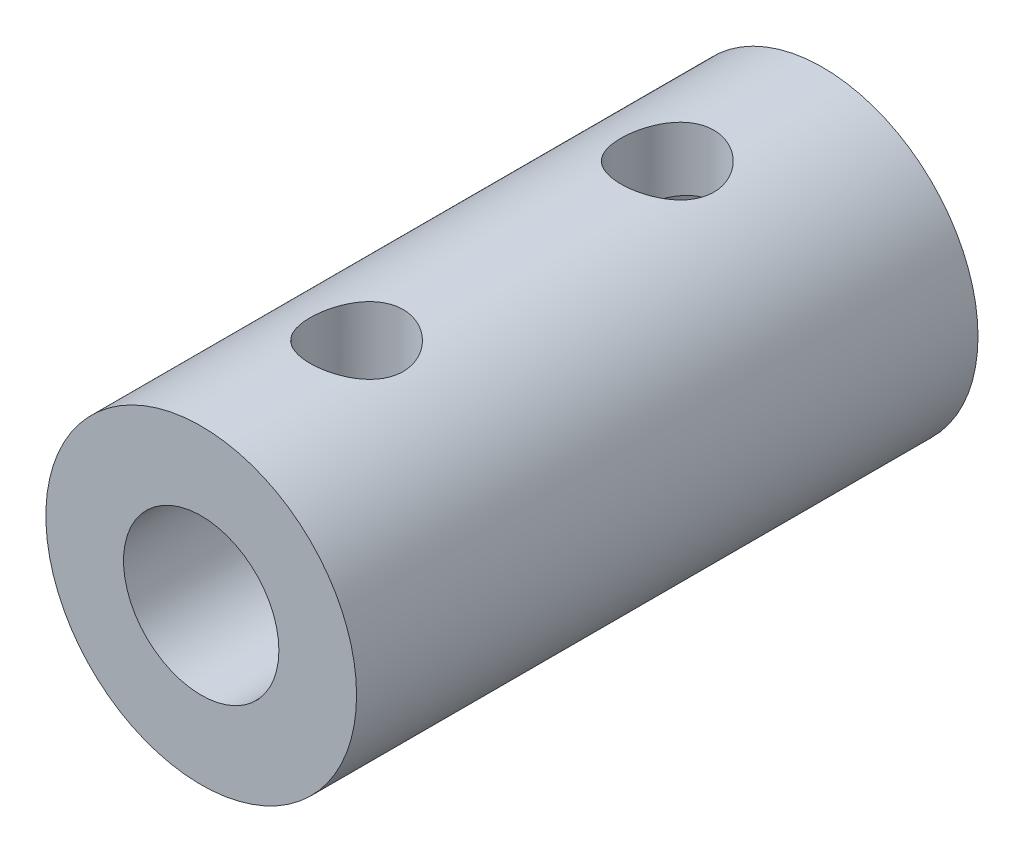
ISO-10303-21;
HEADER;
FILE_DESCRIPTION(('STEP AP214'),'2;1');
FILE_NAME('part.step','',(''),(''),'','','');
FILE_SCHEMA(('AUTOMOTIVE_DESIGN { 1 0 10303 214 1 1 1 1 }'));
ENDSEC;
DATA;
#1=APPLICATION_CONTEXT('core data for automotive mechanical design processes');
#2=APPLICATION_PROTOCOL_DEFINITION('international standard','automotive_design',2000,#1);
#3=PRODUCT_CONTEXT('',#1,'mechanical');
#4=PRODUCT('Part','Part','',(#3));
#5=PRODUCT_RELATED_PRODUCT_CATEGORY('part','',(#4));
#6=PRODUCT_DEFINITION_FORMATION('','',#4);
#7=PRODUCT_DEFINITION_CONTEXT('part definition',#1,'design');
#8=PRODUCT_DEFINITION('design','',#6,#7);
#9=PRODUCT_DEFINITION_SHAPE('','',#8);
#10=(LENGTH_UNIT() NAMED_UNIT(*) SI_UNIT(.MILLI.,.METRE.));
#11=(NAMED_UNIT(*) PLANE_ANGLE_UNIT() SI_UNIT($,.RADIAN.));
#12=(NAMED_UNIT(*) SI_UNIT($,.STERADIAN.) SOLID_ANGLE_UNIT());
#13=UNCERTAINTY_MEASURE_WITH_UNIT(LENGTH_MEASURE(1.E-05),#10,'distance_accuracy_value','');
#14=(GEOMETRIC_REPRESENTATION_CONTEXT(3) GLOBAL_UNCERTAINTY_ASSIGNED_CONTEXT((#13)) GLOBAL_UNIT_ASSIGNED_CONTEXT((#10,
#11,#12)) REPRESENTATION_CONTEXT('',''));
#15=CARTESIAN_POINT('',(0.,0.,0.));
#16=DIRECTION('',(0.,0.,1.));
#17=DIRECTION('',(1.,0.,0.));
#18=AXIS2_PLACEMENT_3D('',#15,#16,#17);
#19=CARTESIAN_POINT('',(0.,0.,10.));
#20=DIRECTION('',(0.,0.,-1.));
#21=DIRECTION('',(-1.,0.,0.));
#22=AXIS2_PLACEMENT_3D('',#19,#20,#21);
#23=CYLINDRICAL_SURFACE('',#22,5.);
#24=CARTESIAN_POINT('',(0.,0.,0.));
#25=DIRECTION('',(0.,0.,1.));
#26=DIRECTION('',(1.,0.,0.));
#27=AXIS2_PLACEMENT_3D('',#24,#25,#26);
#28=CIRCLE('',#27,5.);
#29=CARTESIAN_POINT('',(5.,0.,0.));
#30=VERTEX_POINT('',#29);
#31=EDGE_CURVE('E10',#30,#30,#28,.T.);
#32=ORIENTED_EDGE('',*,*,#31,.T.);
#33=EDGE_LOOP('',(#32));
#34=FACE_BOUND('',#33,.T.);
#35=CARTESIAN_POINT('',(0.,0.,20.));
#36=DIRECTION('',(0.,0.,1.));
#37=DIRECTION('',(1.,0.,0.));
#38=AXIS2_PLACEMENT_3D('',#35,#36,#37);
#39=CIRCLE('',#38,5.);
#40=CARTESIAN_POINT('',(5.,0.,20.));
#41=VERTEX_POINT('',#40);
#42=EDGE_CURVE('E93',#41,#41,#39,.T.);
#43=ORIENTED_EDGE('',*,*,#42,.F.);
#44=EDGE_LOOP('',(#43));
#45=FACE_BOUND('',#44,.T.);
#46=CARTESIAN_POINT('',(0.,5.,13.5));
#47=CARTESIAN_POINT('',(-0.0822886127532981,4.9999992925055,13.5000009974849));
#48=CARTESIAN_POINT('',(-0.164587318351528,4.99794915693954,13.506793863624));
#49=CARTESIAN_POINT('',(-0.326788125304879,4.98997105593691,13.5337213542221));
#50=CARTESIAN_POINT('',(-0.406689504411418,4.98404193389692,13.5538599580233));
#51=CARTESIAN_POINT('',(-0.561732707754525,4.96895552501836,13.6067460169103));
#52=CARTESIAN_POINT('',(-0.636881364395371,4.95980300250425,13.6394748696189));
#53=CARTESIAN_POINT('',(-0.780624181053129,4.93922109237645,13.7165360930558));
#54=CARTESIAN_POINT('',(-0.849217467469668,4.92779140192067,13.7608700073954));
#55=CARTESIAN_POINT('',(-0.979871797183744,4.90350737192774,13.8612240074727));
#56=CARTESIAN_POINT('',(-1.04171807124434,4.89062383657036,13.9175166258859));
#57=CARTESIAN_POINT('',(-1.15524920923324,4.86505834210442,14.0396092299102));
#58=CARTESIAN_POINT('',(-1.20693236327441,4.85237641724501,14.105410812125));
#59=CARTESIAN_POINT('',(-1.29980037723707,4.82834113993772,14.2464707530376));
#60=CARTESIAN_POINT('',(-1.34072309022213,4.81702406663875,14.3219084609907));
#61=CARTESIAN_POINT('',(-1.4092139477476,4.79743620394031,14.4789892542303));
#62=CARTESIAN_POINT('',(-1.43678529919973,4.78916468313311,14.560630843928));
#63=CARTESIAN_POINT('',(-1.47701633682652,4.77690870838434,14.7253902661305));
#64=CARTESIAN_POINT('',(-1.49007196234677,4.77281069324533,14.8084027438639));
#65=CARTESIAN_POINT('',(-1.50213730614672,4.76902789749767,14.9755331562168));
#66=CARTESIAN_POINT('',(-1.50115042761078,4.76934204760571,15.0596508180591));
#67=CARTESIAN_POINT('',(-1.48546977199812,4.77424744067778,15.2233839086085));
#68=CARTESIAN_POINT('',(-1.47127205262685,4.77868388599141,15.3030522503622));
#69=CARTESIAN_POINT('',(-1.43037420427056,4.79108356228624,15.4588197862735));
#70=CARTESIAN_POINT('',(-1.40367284141641,4.79904714132351,15.5349186273743));
#71=CARTESIAN_POINT('',(-1.33816026653681,4.81772733074973,15.6826003496607));
#72=CARTESIAN_POINT('',(-1.29918816934642,4.82848016115952,15.7541070839553));
#73=CARTESIAN_POINT('',(-1.21035222588683,4.85150987000065,15.8897320220102));
#74=CARTESIAN_POINT('',(-1.16048574002588,4.86378711746991,15.9538484294138));
#75=CARTESIAN_POINT('',(-1.04881290765546,4.88911011297937,16.075686190762));
#76=CARTESIAN_POINT('',(-0.986594907466971,4.90216654310498,16.1330286640297));
#77=CARTESIAN_POINT('',(-0.853263259313966,4.92712244063259,16.2365539840643));
#78=CARTESIAN_POINT('',(-0.782149051860887,4.9390218351841,16.2827361284144));
#79=CARTESIAN_POINT('',(-0.632355038342802,4.9604316006947,16.3628599224647));
#80=CARTESIAN_POINT('',(-0.553627749747949,4.96992543668314,16.3967175162499));
#81=CARTESIAN_POINT('',(-0.391245415603517,4.98533521832222,16.4505995900996));
#82=CARTESIAN_POINT('',(-0.307591751589579,4.99125216186999,16.4706279285325));
#83=CARTESIAN_POINT('',(-0.140952242668329,4.99868364643538,16.4956521778994));
#84=CARTESIAN_POINT('',(-0.0580500976011841,5.0003485041779,16.5011615858016));
#85=CARTESIAN_POINT('',(0.107499605823386,4.9995292324176,16.4984308442879));
#86=CARTESIAN_POINT('',(0.190147196690783,4.99704565677756,16.4901925303486));
#87=CARTESIAN_POINT('',(0.350903605309699,4.98830696987163,16.4606153888885));
#88=CARTESIAN_POINT('',(0.429072772614172,4.98213829799417,16.4395766124191));
#89=CARTESIAN_POINT('',(0.580754638954524,4.96674347841533,16.3853567672218));
#90=CARTESIAN_POINT('',(0.654266777025586,4.95751696321085,16.3521742389621));
#91=CARTESIAN_POINT('',(0.796437189461055,4.93669654351325,16.2737468345189));
#92=CARTESIAN_POINT('',(0.864943826199673,4.92505280829675,16.228240659052));
#93=CARTESIAN_POINT('',(0.99352330798015,4.90073468764317,16.1267752459472));
#94=CARTESIAN_POINT('',(1.05359403235594,4.8880600443108,16.0708133881123));
#95=CARTESIAN_POINT('',(1.16585744551027,4.86253171869138,15.9476126916307));
#96=CARTESIAN_POINT('',(1.21768481231504,4.84968825033268,15.8800381242283));
#97=CARTESIAN_POINT('',(1.30928995072154,4.82576515238463,15.7368720609865));
#98=CARTESIAN_POINT('',(1.34906803829472,4.81468547654651,15.6612807754418));
#99=CARTESIAN_POINT('',(1.41517347127169,4.79567189615055,15.5044675087453));
#100=CARTESIAN_POINT('',(1.4415634693705,4.78772337843827,15.4232738134634));
#101=CARTESIAN_POINT('',(1.48021730815114,4.77591594362794,15.2573120310685));
#102=CARTESIAN_POINT('',(1.49248598978779,4.772055625083,15.1725451792123));
#103=CARTESIAN_POINT('',(1.50221984485059,4.76899972496087,15.0056384816238));
#104=CARTESIAN_POINT('',(1.5002805530849,4.76961647442754,14.9235363489824));
#105=CARTESIAN_POINT('',(1.48307505444814,4.77499401288294,14.7608858966272));
#106=CARTESIAN_POINT('',(1.46780938124716,4.77975463592551,14.6803375148236));
#107=CARTESIAN_POINT('',(1.42476888804136,4.79275763670385,14.5240546008571));
#108=CARTESIAN_POINT('',(1.39715175507069,4.80095604545965,14.4482727126383));
#109=CARTESIAN_POINT('',(1.33031507121129,4.81990278909136,14.3023575611823));
#110=CARTESIAN_POINT('',(1.29109329962876,4.83065161194312,14.2322253823592));
#111=CARTESIAN_POINT('',(1.20048763805072,4.85397676425833,14.0968368834729));
#112=CARTESIAN_POINT('',(1.14871276092994,4.86660540163797,14.0318512387396));
#113=CARTESIAN_POINT('',(1.03517434629782,4.89201320450026,13.9112975016921));
#114=CARTESIAN_POINT('',(0.973408217134503,4.90479240823905,13.8557318605322));
#115=CARTESIAN_POINT('',(0.839465762183249,4.92950936570649,13.753976587705));
#116=CARTESIAN_POINT('',(0.767037885790609,4.94141159765674,13.7081085531445));
#117=CARTESIAN_POINT('',(0.615141373983531,4.96260680455813,13.629264830096));
#118=CARTESIAN_POINT('',(0.535676052998957,4.97190099931066,13.5962831117255));
#119=CARTESIAN_POINT('',(0.380757712655283,4.98602174969301,13.5471047243472));
#120=CARTESIAN_POINT('',(0.305786961954236,4.99122027381068,13.5294883271168));
#121=CARTESIAN_POINT('',(0.153880195230781,4.99820944494492,13.5059364747584));
#122=CARTESIAN_POINT('',(0.0769445098581414,5.0000006615474,13.4999990672952));
#123=CARTESIAN_POINT('',(0.,5.,13.5));
#124=B_SPLINE_CURVE_WITH_KNOTS('',3,(#46,#47,#48,#49,#50,#51,#52,#53,#54,#55,#56,#57,#58,#59,
#60,#61,#62,#63,#64,#65,#66,#67,#68,#69,#70,#71,#72,#73,#74,#75,#76,#77,#78,#79,#80,#81,#82,#83,
#84,#85,#86,#87,#88,#89,#90,#91,#92,#93,#94,#95,#96,#97,#98,#99,#100,#101,#102,#103,#104,#105,
#106,#107,#108,#109,#110,#111,#112,#113,#114,#115,#116,#117,#118,#119,#120,#121,#122,#123),
.UNSPECIFIED.,.T.,.F.,(4,2,2,2,2,2,2,2,2,2,2,2,2,2,2,2,2,2,2,2,2,2,2,2,2,2,2,2,2,2,2,2,2,2,2,2,
2,2,4),(0.,0.246583203612611,0.493239964846,0.739533676300874,0.985860164412702,
1.23855602948192,1.49129437288633,1.74971481004109,2.00807314543224,2.25919689356599,
2.51025978319089,2.75226016697676,2.99428443658001,3.2396242644712,3.48502360158555,
3.74067104048167,3.99633456531071,4.25371046881689,4.51101453528808,4.75908809438545,
5.00712853550327,5.24956746682327,5.49203554593729,5.74011305702909,5.98825282000191,
6.24540400322819,6.5025484425268,6.75847814951252,7.01432009460283,7.25950155466943,
7.504673196616,7.74680040402721,7.98897397553107,8.2399692567993,8.49102974897502,
8.74942996156671,9.00770911595235,9.23831691930459,9.46888616948874),.UNSPECIFIED.);
#125=CARTESIAN_POINT('',(0.,5.,13.5));
#126=VERTEX_POINT('',#125);
#127=EDGE_CURVE('E65',#126,#126,#124,.T.);
#128=ORIENTED_EDGE('',*,*,#127,.F.);
#129=EDGE_LOOP('',(#128));
#130=FACE_BOUND('',#129,.T.);
#131=CARTESIAN_POINT('',(0.,5.,3.5));
#132=CARTESIAN_POINT('',(-0.0822886127532993,4.9999992925055,3.50000099748489));
#133=CARTESIAN_POINT('',(-0.164587318351529,4.99794915693954,3.50679386362397));
#134=CARTESIAN_POINT('',(-0.32678812530488,4.98997105593691,3.5337213542221));
#135=CARTESIAN_POINT('',(-0.406689504411419,4.98404193389692,3.55385995802334));
#136=CARTESIAN_POINT('',(-0.561732707754526,4.96895552501836,3.60674601691026));
#137=CARTESIAN_POINT('',(-0.636881364395372,4.95980300250425,3.63947486961894));
#138=CARTESIAN_POINT('',(-0.780624181053131,4.93922109237645,3.71653609305584));
#139=CARTESIAN_POINT('',(-0.849217467469669,4.92779140192067,3.76087000739542));
#140=CARTESIAN_POINT('',(-0.979871797183744,4.90350737192774,3.86122400747267));
#141=CARTESIAN_POINT('',(-1.04171807124434,4.89062383657036,3.91751662588591));
#142=CARTESIAN_POINT('',(-1.15524920923324,4.86505834210442,4.03960922991018));
#143=CARTESIAN_POINT('',(-1.20693236327441,4.85237641724501,4.10541081212496));
#144=CARTESIAN_POINT('',(-1.29980037723708,4.82834113993772,4.24647075303761));
#145=CARTESIAN_POINT('',(-1.34072309022213,4.81702406663875,4.32190846099074));
#146=CARTESIAN_POINT('',(-1.4092139477476,4.79743620394031,4.47898925423029));
#147=CARTESIAN_POINT('',(-1.43678529919973,4.78916468313311,4.56063084392798));
#148=CARTESIAN_POINT('',(-1.47701633682652,4.77690870838434,4.72539026613046));
#149=CARTESIAN_POINT('',(-1.49007196234677,4.77281069324533,4.80840274386394));
#150=CARTESIAN_POINT('',(-1.50213730614672,4.76902789749767,4.97553315621677));
#151=CARTESIAN_POINT('',(-1.50115042761078,4.76934204760571,5.05965081805909));
#152=CARTESIAN_POINT('',(-1.48546977199812,4.77424744067778,5.22338390860849));
#153=CARTESIAN_POINT('',(-1.47127205262685,4.77868388599141,5.30305225036224));
#154=CARTESIAN_POINT('',(-1.43037420427056,4.79108356228624,5.45881978627346));
#155=CARTESIAN_POINT('',(-1.40367284141641,4.79904714132351,5.53491862737433));
#156=CARTESIAN_POINT('',(-1.33816026653682,4.81772733074973,5.68260034966074));
#157=CARTESIAN_POINT('',(-1.29918816934642,4.82848016115952,5.75410708395526));
#158=CARTESIAN_POINT('',(-1.21035222588683,4.85150987000065,5.88973202201019));
#159=CARTESIAN_POINT('',(-1.16048574002588,4.86378711746991,5.95384842941378));
#160=CARTESIAN_POINT('',(-1.04881290765546,4.88911011297937,6.07568619076202));
#161=CARTESIAN_POINT('',(-0.986594907466972,4.90216654310498,6.13302866402967));
#162=CARTESIAN_POINT('',(-0.853263259313966,4.92712244063259,6.23655398406425));
#163=CARTESIAN_POINT('',(-0.782149051860887,4.9390218351841,6.28273612841443));
#164=CARTESIAN_POINT('',(-0.632355038342802,4.9604316006947,6.36285992246473));
#165=CARTESIAN_POINT('',(-0.553627749747949,4.96992543668314,6.39671751624986));
#166=CARTESIAN_POINT('',(-0.391245415603519,4.98533521832222,6.45059959009963));
#167=CARTESIAN_POINT('',(-0.307591751589581,4.99125216186999,6.47062792853249));
#168=CARTESIAN_POINT('',(-0.140952242668331,4.99868364643538,6.4956521778994));
#169=CARTESIAN_POINT('',(-0.0580500976011866,5.0003485041779,6.50116158580161));
#170=CARTESIAN_POINT('',(0.107499605823383,4.9995292324176,6.49843084428792));
#171=CARTESIAN_POINT('',(0.190147196690781,4.99704565677756,6.49019253034856));
#172=CARTESIAN_POINT('',(0.350903605309697,4.98830696987163,6.46061538888851));
#173=CARTESIAN_POINT('',(0.42907277261417,4.98213829799417,6.43957661241913));
#174=CARTESIAN_POINT('',(0.580754638954523,4.96674347841533,6.3853567672218));
#175=CARTESIAN_POINT('',(0.654266777025584,4.95751696321085,6.35217423896214));
#176=CARTESIAN_POINT('',(0.796437189461052,4.93669654351325,6.27374683451887));
#177=CARTESIAN_POINT('',(0.86494382619967,4.92505280829675,6.22824065905203));
#178=CARTESIAN_POINT('',(0.993523307980148,4.90073468764318,6.12677524594719));
#179=CARTESIAN_POINT('',(1.05359403235594,4.8880600443108,6.07081338811233));
#180=CARTESIAN_POINT('',(1.16585744551027,4.86253171869138,5.94761269163066));
#181=CARTESIAN_POINT('',(1.21768481231504,4.84968825033268,5.88003812422826));
#182=CARTESIAN_POINT('',(1.30928995072154,4.82576515238464,5.73687206098647));
#183=CARTESIAN_POINT('',(1.34906803829472,4.81468547654651,5.66128077544179));
#184=CARTESIAN_POINT('',(1.41517347127168,4.79567189615055,5.50446750874531));
#185=CARTESIAN_POINT('',(1.4415634693705,4.78772337843827,5.42327381346341));
#186=CARTESIAN_POINT('',(1.48021730815114,4.77591594362794,5.25731203106852));
#187=CARTESIAN_POINT('',(1.49248598978779,4.772055625083,5.17254517921233));
#188=CARTESIAN_POINT('',(1.50221984485059,4.76899972496087,5.00563848162377));
#189=CARTESIAN_POINT('',(1.5002805530849,4.76961647442754,4.92353634898242));
#190=CARTESIAN_POINT('',(1.48307505444813,4.77499401288294,4.7608858966272));
#191=CARTESIAN_POINT('',(1.46780938124716,4.77975463592551,4.68033751482365));
#192=CARTESIAN_POINT('',(1.42476888804136,4.79275763670386,4.52405460085715));
#193=CARTESIAN_POINT('',(1.39715175507069,4.80095604545965,4.44827271263831));
#194=CARTESIAN_POINT('',(1.33031507121129,4.81990278909136,4.30235756118228));
#195=CARTESIAN_POINT('',(1.29109329962876,4.83065161194312,4.23222538235925));
#196=CARTESIAN_POINT('',(1.20048763805072,4.85397676425833,4.09683688347289));
#197=CARTESIAN_POINT('',(1.14871276092994,4.86660540163798,4.03185123873959));
#198=CARTESIAN_POINT('',(1.03517434629782,4.89201320450026,3.91129750169214));
#199=CARTESIAN_POINT('',(0.973408217134503,4.90479240823905,3.85573186053224));
#200=CARTESIAN_POINT('',(0.839465762183249,4.92950936570649,3.75397658770497));
#201=CARTESIAN_POINT('',(0.767037885790609,4.94141159765674,3.70810855314451));
#202=CARTESIAN_POINT('',(0.615141373983531,4.96260680455813,3.62926483009598));
#203=CARTESIAN_POINT('',(0.535676052998957,4.97190099931066,3.59628311172549));
#204=CARTESIAN_POINT('',(0.380757712655283,4.98602174969301,3.54710472434725));
#205=CARTESIAN_POINT('',(0.305786961954236,4.99122027381068,3.52948832711675));
#206=CARTESIAN_POINT('',(0.153880195230781,4.99820944494492,3.50593647475842));
#207=CARTESIAN_POINT('',(0.0769445098581407,5.0000006615474,3.49999906729518));
#208=CARTESIAN_POINT('',(0.,5.,3.5));
#209=B_SPLINE_CURVE_WITH_KNOTS('',3,(#131,#132,#133,#134,#135,#136,#137,#138,#139,#140,#141,
#142,#143,#144,#145,#146,#147,#148,#149,#150,#151,#152,#153,#154,#155,#156,#157,#158,#159,#160,
#161,#162,#163,#164,#165,#166,#167,#168,#169,#170,#171,#172,#173,#174,#175,#176,#177,#178,#179,
#180,#181,#182,#183,#184,#185,#186,#187,#188,#189,#190,#191,#192,#193,#194,#195,#196,#197,#198,
#199,#200,#201,#202,#203,#204,#205,#206,#207,#208),.UNSPECIFIED.,.T.,.F.,(4,2,2,2,2,2,2,2,2,2,2,
2,2,2,2,2,2,2,2,2,2,2,2,2,2,2,2,2,2,2,2,2,2,2,2,2,2,2,4),(0.,0.246583203612611,0.493239964846,
0.739533676300874,0.985860164412702,1.23855602948191,1.49129437288633,1.74971481004109,
2.00807314543224,2.25919689356599,2.51025978319089,2.75226016697676,2.99428443658001,
3.23962426447119,3.48502360158555,3.74067104048167,3.99633456531072,4.25371046881689,
4.51101453528808,4.75908809438545,5.00712853550327,5.24956746682327,5.49203554593728,
5.74011305702908,5.98825282000191,6.24540400322818,6.5025484425268,6.75847814951252,
7.01432009460283,7.25950155466943,7.504673196616,7.74680040402721,7.98897397553107,
8.2399692567993,8.49102974897502,8.74942996156671,9.00770911595235,9.23831691930459,
9.46888616948874),.UNSPECIFIED.);
#210=CARTESIAN_POINT('',(0.,5.,3.5));
#211=VERTEX_POINT('',#210);
#212=EDGE_CURVE('E83',#211,#211,#209,.T.);
#213=ORIENTED_EDGE('',*,*,#212,.F.);
#214=EDGE_LOOP('',(#213));
#215=FACE_BOUND('',#214,.T.);
#216=ADVANCED_FACE('F37',(#34,#45,#130,#215),#23,.T.);
#217=CARTESIAN_POINT('',(0.,0.,10.));
#218=DIRECTION('',(0.,0.,-1.));
#219=DIRECTION('',(-1.,0.,0.));
#220=AXIS2_PLACEMENT_3D('',#217,#218,#219);
#221=CYLINDRICAL_SURFACE('',#220,3.);
#222=CARTESIAN_POINT('',(0.,0.,0.));
#223=DIRECTION('',(0.,0.,1.));
#224=DIRECTION('',(1.,0.,0.));
#225=AXIS2_PLACEMENT_3D('',#222,#223,#224);
#226=CIRCLE('',#225,3.);
#227=CARTESIAN_POINT('',(3.,0.,0.));
#228=VERTEX_POINT('',#227);
#229=EDGE_CURVE('E50',#228,#228,#226,.T.);
#230=ORIENTED_EDGE('',*,*,#229,.F.);
#231=EDGE_LOOP('',(#230));
#232=FACE_BOUND('',#231,.T.);
#233=CARTESIAN_POINT('',(0.,0.,10.));
#234=DIRECTION('',(0.,0.,1.));
#235=DIRECTION('',(1.,0.,0.));
#236=AXIS2_PLACEMENT_3D('',#233,#234,#235);
#237=CIRCLE('',#236,3.);
#238=CARTESIAN_POINT('',(3.,0.,10.));
#239=VERTEX_POINT('',#238);
#240=EDGE_CURVE('E55',#239,#239,#237,.T.);
#241=ORIENTED_EDGE('',*,*,#240,.T.);
#242=EDGE_LOOP('',(#241));
#243=FACE_BOUND('',#242,.T.);
#244=CARTESIAN_POINT('',(0.,3.,3.5));
#245=CARTESIAN_POINT('',(-0.0788579444268496,2.99999570107562,3.50000495347579));
#246=CARTESIAN_POINT('',(-0.157809899546343,2.99685736529634,3.50625510968158));
#247=CARTESIAN_POINT('',(-0.313380352903344,2.98461234055735,3.53097932051231));
#248=CARTESIAN_POINT('',(-0.389994130070444,2.97549431743379,3.54947658949672));
#249=CARTESIAN_POINT('',(-0.538400317320673,2.95224419105063,3.59779071292494));
#250=CARTESIAN_POINT('',(-0.610210204408719,2.93813158766306,3.62756357637195));
#251=CARTESIAN_POINT('',(-0.747708925209897,2.90618664773642,3.69735593204748));
#252=CARTESIAN_POINT('',(-0.813398240985088,2.88835460450288,3.7373746163733));
#253=CARTESIAN_POINT('',(-0.941261726642863,2.84934387387093,3.82927587422793));
#254=CARTESIAN_POINT('',(-1.00298281668316,2.82802798691306,3.88172971885946));
#255=CARTESIAN_POINT('',(-1.11716916730047,2.78489955370114,3.99578221887056));
#256=CARTESIAN_POINT('',(-1.16962737466015,2.76308664313552,4.05738777765866));
#257=CARTESIAN_POINT('',(-1.26787800067542,2.71948426796021,4.19372502428507));
#258=CARTESIAN_POINT('',(-1.31283800332745,2.69782780455198,4.26910414751887));
#259=CARTESIAN_POINT('',(-1.38925234033604,2.65928968158481,4.42755100397932));
#260=CARTESIAN_POINT('',(-1.4207163224495,2.64240461410484,4.51061319308412));
#261=CARTESIAN_POINT('',(-1.46719866328288,2.61686800556713,4.67699765813289));
#262=CARTESIAN_POINT('',(-1.48308878562066,2.6077840737557,4.76000667810109));
#263=CARTESIAN_POINT('',(-1.50064048996327,2.59772834922791,4.92796825666922));
#264=CARTESIAN_POINT('',(-1.50231613255961,2.59674854014932,5.01291881130673));
#265=CARTESIAN_POINT('',(-1.49203093075844,2.60266395385873,5.17142903647305));
#266=CARTESIAN_POINT('',(-1.48167683930523,2.6086314549302,5.24513604683458));
#267=CARTESIAN_POINT('',(-1.4504097735854,2.62614343100775,5.38958286405956));
#268=CARTESIAN_POINT('',(-1.42949343584648,2.63768968247664,5.46032171795797));
#269=CARTESIAN_POINT('',(-1.37731467057901,2.66531214619112,5.59884369884849));
#270=CARTESIAN_POINT('',(-1.34582260067399,2.68148760995998,5.66651959817868));
#271=CARTESIAN_POINT('',(-1.273562531502,2.71655106422105,5.79595143888501));
#272=CARTESIAN_POINT('',(-1.2327903657187,2.73544027170286,5.85770470340013));
#273=CARTESIAN_POINT('',(-1.13709908236918,2.77669736854929,5.98178187911484));
#274=CARTESIAN_POINT('',(-1.08104168755392,2.79920265355119,6.04318531036424));
#275=CARTESIAN_POINT('',(-0.95933336811206,2.84321434950611,6.15610312788635));
#276=CARTESIAN_POINT('',(-0.893677884861428,2.86472027938201,6.20761278805083));
#277=CARTESIAN_POINT('',(-0.750774758747772,2.90552980924446,6.30152849154459));
#278=CARTESIAN_POINT('',(-0.673130387399113,2.92468476243011,6.34340070866861));
#279=CARTESIAN_POINT('',(-0.510699323233194,2.95736821681863,6.41314554356452));
#280=CARTESIAN_POINT('',(-0.425918364397913,2.9709011841533,6.44102927752275));
#281=CARTESIAN_POINT('',(-0.259149737491053,2.98986500612153,6.47971310557502));
#282=CARTESIAN_POINT('',(-0.177512295822489,2.99587407451965,6.49173685362017));
#283=CARTESIAN_POINT('',(-0.0131693999240267,3.00109520188655,6.50219709670173));
#284=CARTESIAN_POINT('',(0.0695355298048639,3.00031048081978,6.5006400284592));
#285=CARTESIAN_POINT('',(0.226849457978981,2.99236788380152,6.48468996737189));
#286=CARTESIAN_POINT('',(0.301589112074896,2.98570868532252,6.47130120090501));
#287=CARTESIAN_POINT('',(0.447610338452912,2.9673325697226,6.43364289215732));
#288=CARTESIAN_POINT('',(0.518891528536631,2.95561509501618,6.40937215031976));
#289=CARTESIAN_POINT('',(0.65833291267436,2.92776377120382,6.35000230035045));
#290=CARTESIAN_POINT('',(0.726345595508705,2.91151322654446,6.31461342482557));
#291=CARTESIAN_POINT('',(0.855692042548908,2.87615961476126,6.23433869653015));
#292=CARTESIAN_POINT('',(0.917022944664888,2.85705533350407,6.18944879810691));
#293=CARTESIAN_POINT('',(1.03765153393382,2.81562332004297,6.08635936200393));
#294=CARTESIAN_POINT('',(1.09615811672854,2.79316327265249,6.02728569733228));
#295=CARTESIAN_POINT('',(1.20278448167828,2.7489358741323,5.90011227308341));
#296=CARTESIAN_POINT('',(1.25089707856781,2.7271690110007,5.83200632172812));
#297=CARTESIAN_POINT('',(1.33756187171853,2.68576788309734,5.68453451874054));
#298=CARTESIAN_POINT('',(1.37553824370037,2.66628794383591,5.60478310085828));
#299=CARTESIAN_POINT('',(1.43712423890206,2.63361108441202,5.43873489863755));
#300=CARTESIAN_POINT('',(1.46075237380053,2.62040607332625,5.35244671029967));
#301=CARTESIAN_POINT('',(1.49079253120031,2.60342251538703,5.18463466567294));
#302=CARTESIAN_POINT('',(1.49863949460818,2.59886075197597,5.10344861984714));
#303=CARTESIAN_POINT('',(1.5010337315643,2.59748031962405,4.94082939925321));
#304=CARTESIAN_POINT('',(1.49558676993486,2.60065829439585,4.85939634689321));
#305=CARTESIAN_POINT('',(1.47288918838997,2.61356793076615,4.70677474769985));
#306=CARTESIAN_POINT('',(1.45681247151455,2.62264641723988,4.63534929478289));
#307=CARTESIAN_POINT('',(1.41476303733662,2.64556524281479,4.49628782086345));
#308=CARTESIAN_POINT('',(1.38878713673988,2.65940711354503,4.42865302686195));
#309=CARTESIAN_POINT('',(1.32572361795085,2.69142795546803,4.29406272352019));
#310=CARTESIAN_POINT('',(1.28800670672355,2.70983583593881,4.22745814725646));
#311=CARTESIAN_POINT('',(1.20322645745609,2.7485299745229,4.10108819572811));
#312=CARTESIAN_POINT('',(1.15615825686234,2.76881720693416,4.04132640421833));
#313=CARTESIAN_POINT('',(1.04730498999206,2.81193484737138,3.92278702646799));
#314=CARTESIAN_POINT('',(0.984426634495892,2.83477474959942,3.86501134647456));
#315=CARTESIAN_POINT('',(0.849232209349795,2.87816628389896,3.7606055248471));
#316=CARTESIAN_POINT('',(0.776911084957796,2.89871667939293,3.71398139079514));
#317=CARTESIAN_POINT('',(0.623897395174418,2.93547014349806,3.6331454559319));
#318=CARTESIAN_POINT('',(0.543149255665096,2.95164144740899,3.5990237461453));
#319=CARTESIAN_POINT('',(0.37611315170713,2.9775201194848,3.54528774836389));
#320=CARTESIAN_POINT('',(0.28984169938365,2.98724585044602,3.52563222979143));
#321=CARTESIAN_POINT('',(0.168902919736342,2.99543192870217,3.50915388337139));
#322=CARTESIAN_POINT('',(0.135242819162347,2.99714048010376,3.50572603870049));
#323=CARTESIAN_POINT('',(0.0677275977076372,2.99942545465223,3.50114800172887));
#324=CARTESIAN_POINT('',(0.0338724714699429,3.00000184655071,3.49999787229469));
#325=CARTESIAN_POINT('',(0.,3.,3.5));
#326=B_SPLINE_CURVE_WITH_KNOTS('',3,(#244,#245,#246,#247,#248,#249,#250,#251,#252,#253,#254,
#255,#256,#257,#258,#259,#260,#261,#262,#263,#264,#265,#266,#267,#268,#269,#270,#271,#272,#273,
#274,#275,#276,#277,#278,#279,#280,#281,#282,#283,#284,#285,#286,#287,#288,#289,#290,#291,#292,
#293,#294,#295,#296,#297,#298,#299,#300,#301,#302,#303,#304,#305,#306,#307,#308,#309,#310,#311,
#312,#313,#314,#315,#316,#317,#318,#319,#320,#321,#322,#323,#324,#325),.UNSPECIFIED.,.T.,.F.,(4,
2,2,2,2,2,2,2,2,2,2,2,2,2,2,2,2,2,2,2,2,2,2,2,2,2,2,2,2,2,2,2,2,2,2,2,2,2,2,2,4),(0.,
0.236436386130439,0.473322224563797,0.709293233238447,0.945245640872352,1.19547263807713,
1.44588935648105,1.71572589646129,1.98536921847421,2.23887018210344,2.49212035993531,
2.71508568613981,2.93812205888518,3.16635360252731,3.39468781890333,3.65197412000818,
3.90938301898029,4.17874533321661,4.44789325368419,4.69474935707018,4.94148846767214,
5.16910359759183,5.39674382446397,5.63089284041848,5.86514176122509,6.12239415966628,
6.37982382923148,6.64972023242589,6.91926767918176,7.1629396125457,7.40650589797018,
7.62686895373284,7.84730293182527,8.08254685170431,8.31791341715446,8.58187864135757,
8.84598575071869,9.1119602049529,9.37717362931724,9.47872920200875,9.58028757766599),.UNSPECIFIED.);
#327=CARTESIAN_POINT('',(0.,3.,3.5));
#328=VERTEX_POINT('',#327);
#329=EDGE_CURVE('E41',#328,#328,#326,.T.);
#330=ORIENTED_EDGE('',*,*,#329,.T.);
#331=EDGE_LOOP('',(#330));
#332=FACE_BOUND('',#331,.T.);
#333=ADVANCED_FACE('F100',(#232,#243,#332),#221,.F.);
#334=CARTESIAN_POINT('',(0.,0.,20.));
#335=DIRECTION('',(0.,0.,-1.));
#336=DIRECTION('',(-1.,0.,0.));
#337=AXIS2_PLACEMENT_3D('',#334,#335,#336);
#338=CYLINDRICAL_SURFACE('',#337,2.5);
#339=CARTESIAN_POINT('',(0.,0.,10.));
#340=DIRECTION('',(0.,0.,1.));
#341=DIRECTION('',(1.,0.,0.));
#342=AXIS2_PLACEMENT_3D('',#339,#340,#341);
#343=CIRCLE('',#342,2.5);
#344=CARTESIAN_POINT('',(2.5,0.,10.));
#345=VERTEX_POINT('',#344);
#346=EDGE_CURVE('E89',#345,#345,#343,.T.);
#347=ORIENTED_EDGE('',*,*,#346,.F.);
#348=EDGE_LOOP('',(#347));
#349=FACE_BOUND('',#348,.T.);
#350=CARTESIAN_POINT('',(0.,0.,20.));
#351=DIRECTION('',(0.,0.,1.));
#352=DIRECTION('',(1.,0.,0.));
#353=AXIS2_PLACEMENT_3D('',#350,#351,#352);
#354=CIRCLE('',#353,2.5);
#355=CARTESIAN_POINT('',(2.5,0.,20.));
#356=VERTEX_POINT('',#355);
#357=EDGE_CURVE('E90',#356,#356,#354,.T.);
#358=ORIENTED_EDGE('',*,*,#357,.T.);
#359=EDGE_LOOP('',(#358));
#360=FACE_BOUND('',#359,.T.);
#361=CARTESIAN_POINT('',(0.,2.5,13.5));
#362=CARTESIAN_POINT('',(-0.0767298334620139,2.49999625789732,13.5000040910099));
#363=CARTESIAN_POINT('',(-0.153582320644176,2.4964290461501,13.5059286709263));
#364=CARTESIAN_POINT('',(-0.304975509530677,2.48249903608568,13.5293243195153));
#365=CARTESIAN_POINT('',(-0.379510034596045,2.47211948032719,13.5468238618542));
#366=CARTESIAN_POINT('',(-0.523751827790835,2.44561558054488,13.5923863611669));
#367=CARTESIAN_POINT('',(-0.593481028226564,2.42951973272944,13.6203969581632));
#368=CARTESIAN_POINT('',(-0.727030318214657,2.39295367626407,13.685860333141));
#369=CARTESIAN_POINT('',(-0.790851869416381,2.37248455380255,13.7233107669687));
#370=CARTESIAN_POINT('',(-0.916299278999313,2.32705360719088,13.8097748267086));
#371=CARTESIAN_POINT('',(-0.977384020081413,2.30186792195985,13.8594536953514));
#372=CARTESIAN_POINT('',(-1.09088270411891,2.25030439279634,13.9674672038283));
#373=CARTESIAN_POINT('',(-1.14328534948112,2.22392505153571,14.0258129371873));
#374=CARTESIAN_POINT('',(-1.24444996762974,2.1691106699591,14.1579235104967));
#375=CARTESIAN_POINT('',(-1.29197766378809,2.14082017703649,14.2327017709813));
#376=CARTESIAN_POINT('',(-1.37361437764896,2.08938301412124,14.3908465732431));
#377=CARTESIAN_POINT('',(-1.40774517335159,2.06622802273938,14.4741988962476));
#378=CARTESIAN_POINT('',(-1.45440601714221,2.0335462966093,14.6265964506532));
#379=CARTESIAN_POINT('',(-1.47016197246826,2.02207883137591,14.6942359986103));
#380=CARTESIAN_POINT('',(-1.49216172340475,2.00590308295503,14.8318037158304));
#381=CARTESIAN_POINT('',(-1.49841734556835,2.0011863964376,14.9017289287545));
#382=CARTESIAN_POINT('',(-1.50105508796008,1.99920922463856,15.0420114942173));
#383=CARTESIAN_POINT('',(-1.49741783408418,2.00196337012718,15.1123694250932));
#384=CARTESIAN_POINT('',(-1.48046060478828,2.01453261443741,15.2512787754276));
#385=CARTESIAN_POINT('',(-1.46713334620103,2.02435302432226,15.3198287958474));
#386=CARTESIAN_POINT('',(-1.43173921881792,2.04953186944258,15.4525302421281));
#387=CARTESIAN_POINT('',(-1.40978748666087,2.06481711652537,15.5167270539245));
#388=CARTESIAN_POINT('',(-1.35795061770837,2.09927051350828,15.6406949909281));
#389=CARTESIAN_POINT('',(-1.32806257259705,2.11844008623465,15.7004644834239));
#390=CARTESIAN_POINT('',(-1.25517983184583,2.16255327268985,15.8249840971228));
#391=CARTESIAN_POINT('',(-1.21080724397723,2.18792043372992,15.8887780929549));
#392=CARTESIAN_POINT('',(-1.11291092784003,2.23930599764381,16.008676483667));
#393=CARTESIAN_POINT('',(-1.05937845100578,2.26532500262149,16.0647734339765));
#394=CARTESIAN_POINT('',(-0.935811834382963,2.31935504958317,16.1756129818218));
#395=CARTESIAN_POINT('',(-0.864517682704954,2.34713836268533,16.229077306016));
#396=CARTESIAN_POINT('',(-0.712276050458997,2.39772428433981,16.3231220471979));
#397=CARTESIAN_POINT('',(-0.631333763943562,2.42052955425515,16.36370935379));
#398=CARTESIAN_POINT('',(-0.467197585268205,2.45730392066151,16.4279321827959));
#399=CARTESIAN_POINT('',(-0.384467624173579,2.47173957439704,16.4524753557159));
#400=CARTESIAN_POINT('',(-0.215047895144638,2.49218842813551,16.4870111974054));
#401=CARTESIAN_POINT('',(-0.128363005661318,2.49821172952738,16.4970213177536));
#402=CARTESIAN_POINT('',(0.0337146143773979,2.5009057037461,16.5015078476783));
#403=CARTESIAN_POINT('',(0.10904247341872,2.49873521714286,16.4979088550852));
#404=CARTESIAN_POINT('',(0.257829401986062,2.48778712087048,16.4795741469281));
#405=CARTESIAN_POINT('',(0.331288509376107,2.47900964518037,16.4648386571942));
#406=CARTESIAN_POINT('',(0.472574932157614,2.4559479244219,16.4254565671875));
#407=CARTESIAN_POINT('',(0.540495750928485,2.44180275662555,16.4010596509265));
#408=CARTESIAN_POINT('',(0.671265749087264,2.40913880862844,16.3433226236347));
#409=CARTESIAN_POINT('',(0.734113924963909,2.39061916586511,16.3099807486533));
#410=CARTESIAN_POINT('',(0.860006262823864,2.3484549623736,16.2314430207913));
#411=CARTESIAN_POINT('',(0.922394150456838,2.3244780273988,16.1853761709216));
#412=CARTESIAN_POINT('',(1.03902603131014,2.27474265574731,16.0846086065114));
#413=CARTESIAN_POINT('',(1.09326040273738,2.2489821658636,16.0298978451475));
#414=CARTESIAN_POINT('',(1.19931996735579,2.19445423909891,15.9050896099628));
#415=CARTESIAN_POINT('',(1.24991019630915,2.16573241746291,15.8339161145345));
#416=CARTESIAN_POINT('',(1.33845238915668,2.1121618206671,15.6827839754318));
#417=CARTESIAN_POINT('',(1.37641766769781,2.0873089799769,15.6028347061072));
#418=CARTESIAN_POINT('',(1.43142578795777,2.04984909240519,15.4537569776933));
#419=CARTESIAN_POINT('',(1.4512162533619,2.03575659328728,15.3860196876414));
#420=CARTESIAN_POINT('',(1.48113663905972,2.01409605743544,15.2474679219199));
#421=CARTESIAN_POINT('',(1.49127995297631,2.00651897642721,15.1766578556722));
#422=CARTESIAN_POINT('',(1.50134130416631,1.99900446616267,15.033623052403));
#423=CARTESIAN_POINT('',(1.50122089107869,1.99909576445937,14.961394009313));
#424=CARTESIAN_POINT('',(1.49066472959328,2.0069771789285,14.8181055643905));
#425=CARTESIAN_POINT('',(1.48022337215759,2.0147714813882,14.7470468199194));
#426=CARTESIAN_POINT('',(1.45040174148913,2.0363318524298,14.6115115824278));
#427=CARTESIAN_POINT('',(1.43147636845352,2.0497921180558,14.5468829056931));
#428=CARTESIAN_POINT('',(1.38563242076994,2.08105501960151,14.4216627455258));
#429=CARTESIAN_POINT('',(1.3587108358848,2.09885929040482,14.3610727930395));
#430=CARTESIAN_POINT('',(1.29289245555733,2.14012990550916,14.2356801427792));
#431=CARTESIAN_POINT('',(1.25279167675753,2.16404587582639,14.1716588961457));
#432=CARTESIAN_POINT('',(1.16375698389085,2.21320127030767,14.0506199273827));
#433=CARTESIAN_POINT('',(1.11481579607799,2.23844177205021,13.9936080378474));
#434=CARTESIAN_POINT('',(1.00009777425735,2.29225690291476,13.8786490508683));
#435=CARTESIAN_POINT('',(0.932876819313909,2.32070308663658,13.8220689251038));
#436=CARTESIAN_POINT('',(0.788462434445594,2.37365428872367,13.7209021441367));
#437=CARTESIAN_POINT('',(0.711265444501545,2.39815789310935,13.6763197880152));
#438=CARTESIAN_POINT('',(0.551125230801459,2.43985578654394,13.6022141924263));
#439=CARTESIAN_POINT('',(0.468430086957219,2.45725077479787,13.5722719350732));
#440=CARTESIAN_POINT('',(0.297973306118814,2.48366273001246,13.527275304789));
#441=CARTESIAN_POINT('',(0.210232099648619,2.49271125871485,13.512164832143));
#442=CARTESIAN_POINT('',(0.101558096917542,2.49802001168187,13.5033025452913));
#443=CARTESIAN_POINT('',(0.0812762590282823,2.49876114656362,13.5020655826939));
#444=CARTESIAN_POINT('',(0.0406658206871157,2.49975164517367,13.5004137536291));
#445=CARTESIAN_POINT('',(0.020337218637572,2.50000099184316,13.4999989156791));
#446=CARTESIAN_POINT('',(0.,2.5,13.5));
#447=B_SPLINE_CURVE_WITH_KNOTS('',3,(#361,#362,#363,#364,#365,#366,#367,#368,#369,#370,#371,
#372,#373,#374,#375,#376,#377,#378,#379,#380,#381,#382,#383,#384,#385,#386,#387,#388,#389,#390,
#391,#392,#393,#394,#395,#396,#397,#398,#399,#400,#401,#402,#403,#404,#405,#406,#407,#408,#409,
#410,#411,#412,#413,#414,#415,#416,#417,#418,#419,#420,#421,#422,#423,#424,#425,#426,#427,#428,
#429,#430,#431,#432,#433,#434,#435,#436,#437,#438,#439,#440,#441,#442,#443,#444,#445,#446),
.UNSPECIFIED.,.T.,.F.,(4,2,2,2,2,2,2,2,2,2,2,2,2,2,2,2,2,2,2,2,2,2,2,2,2,2,2,2,2,2,2,2,2,2,2,2,
2,2,2,2,2,2,4),(0.,0.230102237548649,0.460772627520012,0.690308884600012,0.919788197992274,
1.16681590732472,1.414162579348,1.69183813189807,1.96906040692092,2.17933829855633,
2.38935420916578,2.59978170870726,2.81036753273872,3.01823267593207,3.22617409809868,
3.47046995225163,3.71500044803675,3.99360957884691,4.27206939275324,4.53296790696559,
4.79355286918236,5.01875602722426,5.24395461863455,5.46367785689772,5.68344445659025,
5.92601365818362,6.16886690081836,6.44336762428009,6.71757792616456,6.93257787314692,
7.14727888733318,7.36278425777432,7.57840681155725,7.78364098331141,7.98895251523034,
8.22578610052286,8.46281544370207,8.73854311775519,9.01436946031985,9.28175654462677,
9.54812832184448,9.60911473335177,9.67010326027641),.UNSPECIFIED.);
#448=CARTESIAN_POINT('',(0.,2.5,13.5));
#449=VERTEX_POINT('',#448);
#450=EDGE_CURVE('E58',#449,#449,#447,.T.);
#451=ORIENTED_EDGE('',*,*,#450,.T.);
#452=EDGE_LOOP('',(#451));
#453=FACE_BOUND('',#452,.T.);
#454=ADVANCED_FACE('F66',(#349,#360,#453),#338,.F.);
#455=CARTESIAN_POINT('',(0.,0.,0.));
#456=DIRECTION('',(0.,0.,1.));
#457=DIRECTION('',(1.,0.,0.));
#458=AXIS2_PLACEMENT_3D('',#455,#456,#457);
#459=PLANE('',#458);
#460=ORIENTED_EDGE('',*,*,#31,.F.);
#461=EDGE_LOOP('',(#460));
#462=FACE_BOUND('',#461,.T.);
#463=ORIENTED_EDGE('',*,*,#229,.T.);
#464=EDGE_LOOP('',(#463));
#465=FACE_BOUND('',#464,.T.);
#466=ADVANCED_FACE('F105',(#462,#465),#459,.F.);
#467=CARTESIAN_POINT('',(0.,0.,10.));
#468=DIRECTION('',(0.,0.,1.));
#469=DIRECTION('',(1.,0.,0.));
#470=AXIS2_PLACEMENT_3D('',#467,#468,#469);
#471=PLANE('',#470);
#472=ORIENTED_EDGE('',*,*,#346,.T.);
#473=EDGE_LOOP('',(#472));
#474=FACE_BOUND('',#473,.T.);
#475=ORIENTED_EDGE('',*,*,#240,.F.);
#476=EDGE_LOOP('',(#475));
#477=FACE_BOUND('',#476,.T.);
#478=ADVANCED_FACE('F103',(#474,#477),#471,.F.);
#479=CARTESIAN_POINT('',(0.,0.,20.));
#480=DIRECTION('',(0.,0.,1.));
#481=DIRECTION('',(1.,0.,0.));
#482=AXIS2_PLACEMENT_3D('',#479,#480,#481);
#483=PLANE('',#482);
#484=ORIENTED_EDGE('',*,*,#42,.T.);
#485=EDGE_LOOP('',(#484));
#486=FACE_BOUND('',#485,.T.);
#487=ORIENTED_EDGE('',*,*,#357,.F.);
#488=EDGE_LOOP('',(#487));
#489=FACE_BOUND('',#488,.T.);
#490=ADVANCED_FACE('F73',(#486,#489),#483,.T.);
#491=CARTESIAN_POINT('',(0.,10.,15.));
#492=DIRECTION('',(0.,-1.,0.));
#493=DIRECTION('',(0.,0.,-1.));
#494=AXIS2_PLACEMENT_3D('',#491,#492,#493);
#495=CYLINDRICAL_SURFACE('',#494,1.5);
#496=ORIENTED_EDGE('',*,*,#450,.F.);
#497=EDGE_LOOP('',(#496));
#498=FACE_BOUND('',#497,.T.);
#499=ORIENTED_EDGE('',*,*,#127,.T.);
#500=EDGE_LOOP('',(#499));
#501=FACE_BOUND('',#500,.T.);
#502=ADVANCED_FACE('F69',(#498,#501),#495,.F.);
#503=CARTESIAN_POINT('',(0.,10.,5.));
#504=DIRECTION('',(0.,-1.,0.));
#505=DIRECTION('',(0.,0.,-1.));
#506=AXIS2_PLACEMENT_3D('',#503,#504,#505);
#507=CYLINDRICAL_SURFACE('',#506,1.5);
#508=ORIENTED_EDGE('',*,*,#329,.F.);
#509=EDGE_LOOP('',(#508));
#510=FACE_BOUND('',#509,.T.);
#511=ORIENTED_EDGE('',*,*,#212,.T.);
#512=EDGE_LOOP('',(#511));
#513=FACE_BOUND('',#512,.T.);
#514=ADVANCED_FACE('F72',(#510,#513),#507,.F.);
#515=CLOSED_SHELL('',(#216,#333,#454,#466,#478,#490,#502,#514));
#516=MANIFOLD_SOLID_BREP('B2',#515);
#517=ADVANCED_BREP_SHAPE_REPRESENTATION('',(#18,#516),#14);
#518=SHAPE_DEFINITION_REPRESENTATION(#9,#517);
ENDSEC;
END-ISO-10303-21;
